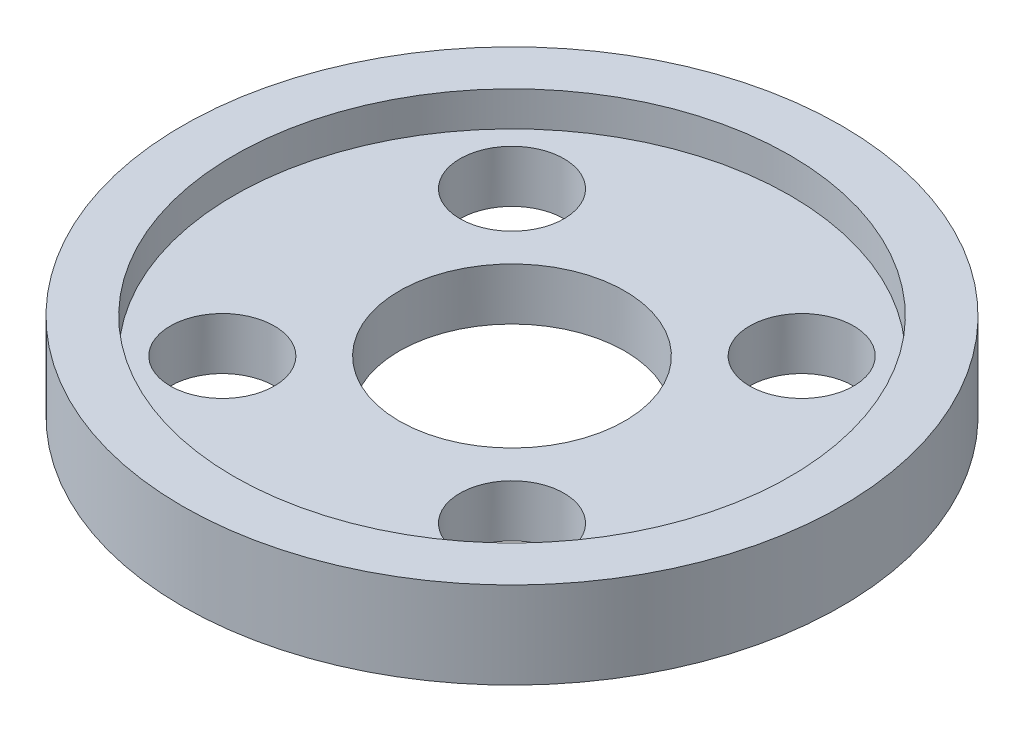
ISO-10303-21;
HEADER;
FILE_DESCRIPTION(('STEP AP214'),'2;1');
FILE_NAME('part.step','',(''),(''),'','','');
FILE_SCHEMA(('AUTOMOTIVE_DESIGN { 1 0 10303 214 1 1 1 1 }'));
ENDSEC;
DATA;
#1=APPLICATION_CONTEXT('core data for automotive mechanical design processes');
#2=APPLICATION_PROTOCOL_DEFINITION('international standard','automotive_design',2000,#1);
#3=PRODUCT_CONTEXT('',#1,'mechanical');
#4=PRODUCT('Part','Part','',(#3));
#5=PRODUCT_RELATED_PRODUCT_CATEGORY('part','',(#4));
#6=PRODUCT_DEFINITION_FORMATION('','',#4);
#7=PRODUCT_DEFINITION_CONTEXT('part definition',#1,'design');
#8=PRODUCT_DEFINITION('design','',#6,#7);
#9=PRODUCT_DEFINITION_SHAPE('','',#8);
#10=(LENGTH_UNIT() NAMED_UNIT(*) SI_UNIT(.MILLI.,.METRE.));
#11=(NAMED_UNIT(*) PLANE_ANGLE_UNIT() SI_UNIT($,.RADIAN.));
#12=(NAMED_UNIT(*) SI_UNIT($,.STERADIAN.) SOLID_ANGLE_UNIT());
#13=UNCERTAINTY_MEASURE_WITH_UNIT(LENGTH_MEASURE(1.E-05),#10,'distance_accuracy_value','');
#14=(GEOMETRIC_REPRESENTATION_CONTEXT(3) GLOBAL_UNCERTAINTY_ASSIGNED_CONTEXT((#13)) GLOBAL_UNIT_ASSIGNED_CONTEXT((#10,
#11,#12)) REPRESENTATION_CONTEXT('',''));
#15=CARTESIAN_POINT('',(0.,0.,0.));
#16=DIRECTION('',(0.,0.,1.));
#17=DIRECTION('',(1.,0.,0.));
#18=AXIS2_PLACEMENT_3D('',#15,#16,#17);
#19=CARTESIAN_POINT('',(0.,0.,0.));
#20=DIRECTION('',(0.,1.,0.));
#21=DIRECTION('',(0.,0.,1.));
#22=AXIS2_PLACEMENT_3D('',#19,#20,#21);
#23=CYLINDRICAL_SURFACE('',#22,19.);
#24=CARTESIAN_POINT('',(0.,32.,0.));
#25=DIRECTION('',(0.,-1.,0.));
#26=DIRECTION('',(0.,0.,-1.));
#27=AXIS2_PLACEMENT_3D('',#24,#25,#26);
#28=CIRCLE('',#27,19.);
#29=CARTESIAN_POINT('',(0.,32.,-19.));
#30=VERTEX_POINT('',#29);
#31=EDGE_CURVE('E61',#30,#30,#28,.F.);
#32=ORIENTED_EDGE('',*,*,#31,.T.);
#33=EDGE_LOOP('',(#32));
#34=FACE_BOUND('',#33,.T.);
#35=CARTESIAN_POINT('',(0.,37.,0.));
#36=DIRECTION('',(0.,1.,0.));
#37=DIRECTION('',(0.,0.,1.));
#38=AXIS2_PLACEMENT_3D('',#35,#36,#37);
#39=CIRCLE('',#38,19.);
#40=CARTESIAN_POINT('',(0.,37.,19.));
#41=VERTEX_POINT('',#40);
#42=EDGE_CURVE('E73',#41,#41,#39,.T.);
#43=ORIENTED_EDGE('',*,*,#42,.F.);
#44=EDGE_LOOP('',(#43));
#45=FACE_BOUND('',#44,.T.);
#46=ADVANCED_FACE('F43',(#34,#45),#23,.T.);
#47=CARTESIAN_POINT('',(0.,35.,0.));
#48=DIRECTION('',(0.,1.,0.));
#49=DIRECTION('',(0.,0.,1.));
#50=AXIS2_PLACEMENT_3D('',#47,#48,#49);
#51=CYLINDRICAL_SURFACE('',#50,16.035);
#52=CARTESIAN_POINT('',(0.,35.,0.));
#53=DIRECTION('',(0.,1.,0.));
#54=DIRECTION('',(0.,0.,1.));
#55=AXIS2_PLACEMENT_3D('',#52,#53,#54);
#56=CIRCLE('',#55,16.035);
#57=CARTESIAN_POINT('',(0.,35.,16.035));
#58=VERTEX_POINT('',#57);
#59=EDGE_CURVE('E52',#58,#58,#56,.T.);
#60=ORIENTED_EDGE('',*,*,#59,.F.);
#61=EDGE_LOOP('',(#60));
#62=FACE_BOUND('',#61,.T.);
#63=CARTESIAN_POINT('',(0.,37.,0.));
#64=DIRECTION('',(0.,1.,0.));
#65=DIRECTION('',(0.,0.,1.));
#66=AXIS2_PLACEMENT_3D('',#63,#64,#65);
#67=CIRCLE('',#66,16.035);
#68=CARTESIAN_POINT('',(0.,37.,16.035));
#69=VERTEX_POINT('',#68);
#70=EDGE_CURVE('E47',#69,#69,#67,.F.);
#71=ORIENTED_EDGE('',*,*,#70,.F.);
#72=EDGE_LOOP('',(#71));
#73=FACE_BOUND('',#72,.T.);
#74=ADVANCED_FACE('F124',(#62,#73),#51,.F.);
#75=CARTESIAN_POINT('',(0.,0.,0.));
#76=DIRECTION('',(0.,1.,0.));
#77=DIRECTION('',(0.,0.,1.));
#78=AXIS2_PLACEMENT_3D('',#75,#76,#77);
#79=CYLINDRICAL_SURFACE('',#78,6.5);
#80=CARTESIAN_POINT('',(0.,35.,0.));
#81=DIRECTION('',(0.,1.,0.));
#82=DIRECTION('',(0.,0.,1.));
#83=AXIS2_PLACEMENT_3D('',#80,#81,#82);
#84=CIRCLE('',#83,6.5);
#85=CARTESIAN_POINT('',(0.,35.,6.5));
#86=VERTEX_POINT('',#85);
#87=EDGE_CURVE('E10',#86,#86,#84,.F.);
#88=ORIENTED_EDGE('',*,*,#87,.F.);
#89=EDGE_LOOP('',(#88));
#90=FACE_BOUND('',#89,.T.);
#91=CARTESIAN_POINT('',(0.,32.,0.));
#92=DIRECTION('',(0.,-1.,0.));
#93=DIRECTION('',(0.,0.,-1.));
#94=AXIS2_PLACEMENT_3D('',#91,#92,#93);
#95=CIRCLE('',#94,6.5);
#96=CARTESIAN_POINT('',(0.,32.,-6.5));
#97=VERTEX_POINT('',#96);
#98=EDGE_CURVE('E93',#97,#97,#95,.F.);
#99=ORIENTED_EDGE('',*,*,#98,.F.);
#100=EDGE_LOOP('',(#99));
#101=FACE_BOUND('',#100,.T.);
#102=ADVANCED_FACE('F45',(#90,#101),#79,.F.);
#103=CARTESIAN_POINT('',(-8.35,-9.5,-8.35));
#104=DIRECTION('',(0.,1.,0.));
#105=DIRECTION('',(0.,0.,1.));
#106=AXIS2_PLACEMENT_3D('',#103,#104,#105);
#107=CYLINDRICAL_SURFACE('',#106,3.);
#108=CARTESIAN_POINT('',(-8.35,35.,-8.35));
#109=DIRECTION('',(0.,1.,0.));
#110=DIRECTION('',(0.,0.,1.));
#111=AXIS2_PLACEMENT_3D('',#108,#109,#110);
#112=CIRCLE('',#111,3.);
#113=CARTESIAN_POINT('',(-8.35,35.,-5.35));
#114=VERTEX_POINT('',#113);
#115=EDGE_CURVE('E58',#114,#114,#112,.T.);
#116=ORIENTED_EDGE('',*,*,#115,.T.);
#117=EDGE_LOOP('',(#116));
#118=FACE_BOUND('',#117,.T.);
#119=CARTESIAN_POINT('',(-8.35,32.,-8.35));
#120=DIRECTION('',(0.,-1.,0.));
#121=DIRECTION('',(0.,0.,-1.));
#122=AXIS2_PLACEMENT_3D('',#119,#120,#121);
#123=CIRCLE('',#122,3.);
#124=CARTESIAN_POINT('',(-8.35,32.,-11.35));
#125=VERTEX_POINT('',#124);
#126=EDGE_CURVE('E89',#125,#125,#123,.F.);
#127=ORIENTED_EDGE('',*,*,#126,.F.);
#128=EDGE_LOOP('',(#127));
#129=FACE_BOUND('',#128,.T.);
#130=ADVANCED_FACE('F112',(#118,#129),#107,.F.);
#131=CARTESIAN_POINT('',(8.35,-9.5,-8.35));
#132=DIRECTION('',(0.,1.,0.));
#133=DIRECTION('',(0.,0.,1.));
#134=AXIS2_PLACEMENT_3D('',#131,#132,#133);
#135=CYLINDRICAL_SURFACE('',#134,3.);
#136=CARTESIAN_POINT('',(8.35,35.,-8.35));
#137=DIRECTION('',(0.,1.,0.));
#138=DIRECTION('',(0.,0.,1.));
#139=AXIS2_PLACEMENT_3D('',#136,#137,#138);
#140=CIRCLE('',#139,3.);
#141=CARTESIAN_POINT('',(8.35,35.,-5.35));
#142=VERTEX_POINT('',#141);
#143=EDGE_CURVE('E98',#142,#142,#140,.T.);
#144=ORIENTED_EDGE('',*,*,#143,.T.);
#145=EDGE_LOOP('',(#144));
#146=FACE_BOUND('',#145,.T.);
#147=CARTESIAN_POINT('',(8.35,32.,-8.35));
#148=DIRECTION('',(0.,-1.,0.));
#149=DIRECTION('',(0.,0.,-1.));
#150=AXIS2_PLACEMENT_3D('',#147,#148,#149);
#151=CIRCLE('',#150,3.);
#152=CARTESIAN_POINT('',(8.35,32.,-11.35));
#153=VERTEX_POINT('',#152);
#154=EDGE_CURVE('E85',#153,#153,#151,.F.);
#155=ORIENTED_EDGE('',*,*,#154,.F.);
#156=EDGE_LOOP('',(#155));
#157=FACE_BOUND('',#156,.T.);
#158=ADVANCED_FACE('F137',(#146,#157),#135,.F.);
#159=CARTESIAN_POINT('',(8.35,-9.5,8.35));
#160=DIRECTION('',(0.,1.,0.));
#161=DIRECTION('',(0.,0.,1.));
#162=AXIS2_PLACEMENT_3D('',#159,#160,#161);
#163=CYLINDRICAL_SURFACE('',#162,3.);
#164=CARTESIAN_POINT('',(8.35,35.,8.35));
#165=DIRECTION('',(0.,1.,0.));
#166=DIRECTION('',(0.,0.,1.));
#167=AXIS2_PLACEMENT_3D('',#164,#165,#166);
#168=CIRCLE('',#167,3.);
#169=CARTESIAN_POINT('',(8.35,35.,11.35));
#170=VERTEX_POINT('',#169);
#171=EDGE_CURVE('E102',#170,#170,#168,.T.);
#172=ORIENTED_EDGE('',*,*,#171,.T.);
#173=EDGE_LOOP('',(#172));
#174=FACE_BOUND('',#173,.T.);
#175=CARTESIAN_POINT('',(8.35,32.,8.35));
#176=DIRECTION('',(0.,-1.,0.));
#177=DIRECTION('',(0.,0.,-1.));
#178=AXIS2_PLACEMENT_3D('',#175,#176,#177);
#179=CIRCLE('',#178,3.);
#180=CARTESIAN_POINT('',(8.35,32.,5.35));
#181=VERTEX_POINT('',#180);
#182=EDGE_CURVE('E70',#181,#181,#179,.F.);
#183=ORIENTED_EDGE('',*,*,#182,.F.);
#184=EDGE_LOOP('',(#183));
#185=FACE_BOUND('',#184,.T.);
#186=ADVANCED_FACE('F140',(#174,#185),#163,.F.);
#187=CARTESIAN_POINT('',(-8.35,-9.5,8.35));
#188=DIRECTION('',(0.,1.,0.));
#189=DIRECTION('',(0.,0.,1.));
#190=AXIS2_PLACEMENT_3D('',#187,#188,#189);
#191=CYLINDRICAL_SURFACE('',#190,3.);
#192=CARTESIAN_POINT('',(-8.35,35.,8.35));
#193=DIRECTION('',(0.,1.,0.));
#194=DIRECTION('',(0.,0.,1.));
#195=AXIS2_PLACEMENT_3D('',#192,#193,#194);
#196=CIRCLE('',#195,3.);
#197=CARTESIAN_POINT('',(-8.35,35.,11.35));
#198=VERTEX_POINT('',#197);
#199=EDGE_CURVE('E97',#198,#198,#196,.T.);
#200=ORIENTED_EDGE('',*,*,#199,.T.);
#201=EDGE_LOOP('',(#200));
#202=FACE_BOUND('',#201,.T.);
#203=CARTESIAN_POINT('',(-8.35,32.,8.35));
#204=DIRECTION('',(0.,-1.,0.));
#205=DIRECTION('',(0.,0.,-1.));
#206=AXIS2_PLACEMENT_3D('',#203,#204,#205);
#207=CIRCLE('',#206,3.);
#208=CARTESIAN_POINT('',(-8.35,32.,5.35));
#209=VERTEX_POINT('',#208);
#210=EDGE_CURVE('E64',#209,#209,#207,.F.);
#211=ORIENTED_EDGE('',*,*,#210,.F.);
#212=EDGE_LOOP('',(#211));
#213=FACE_BOUND('',#212,.T.);
#214=ADVANCED_FACE('F119',(#202,#213),#191,.F.);
#215=CARTESIAN_POINT('',(0.,35.,0.));
#216=DIRECTION('',(0.,1.,0.));
#217=DIRECTION('',(0.,0.,1.));
#218=AXIS2_PLACEMENT_3D('',#215,#216,#217);
#219=PLANE('',#218);
#220=ORIENTED_EDGE('',*,*,#199,.F.);
#221=EDGE_LOOP('',(#220));
#222=FACE_BOUND('',#221,.T.);
#223=ORIENTED_EDGE('',*,*,#171,.F.);
#224=EDGE_LOOP('',(#223));
#225=FACE_BOUND('',#224,.T.);
#226=ORIENTED_EDGE('',*,*,#143,.F.);
#227=EDGE_LOOP('',(#226));
#228=FACE_BOUND('',#227,.T.);
#229=ORIENTED_EDGE('',*,*,#115,.F.);
#230=EDGE_LOOP('',(#229));
#231=FACE_BOUND('',#230,.T.);
#232=ORIENTED_EDGE('',*,*,#59,.T.);
#233=EDGE_LOOP('',(#232));
#234=FACE_BOUND('',#233,.T.);
#235=ORIENTED_EDGE('',*,*,#87,.T.);
#236=EDGE_LOOP('',(#235));
#237=FACE_BOUND('',#236,.T.);
#238=ADVANCED_FACE('F115',(#222,#225,#228,#231,#234,#237),#219,.T.);
#239=CARTESIAN_POINT('',(0.,32.,0.));
#240=DIRECTION('',(0.,-1.,0.));
#241=DIRECTION('',(0.,0.,-1.));
#242=AXIS2_PLACEMENT_3D('',#239,#240,#241);
#243=PLANE('',#242);
#244=ORIENTED_EDGE('',*,*,#31,.F.);
#245=EDGE_LOOP('',(#244));
#246=FACE_BOUND('',#245,.T.);
#247=ORIENTED_EDGE('',*,*,#210,.T.);
#248=EDGE_LOOP('',(#247));
#249=FACE_BOUND('',#248,.T.);
#250=ORIENTED_EDGE('',*,*,#182,.T.);
#251=EDGE_LOOP('',(#250));
#252=FACE_BOUND('',#251,.T.);
#253=ORIENTED_EDGE('',*,*,#154,.T.);
#254=EDGE_LOOP('',(#253));
#255=FACE_BOUND('',#254,.T.);
#256=ORIENTED_EDGE('',*,*,#126,.T.);
#257=EDGE_LOOP('',(#256));
#258=FACE_BOUND('',#257,.T.);
#259=ORIENTED_EDGE('',*,*,#98,.T.);
#260=EDGE_LOOP('',(#259));
#261=FACE_BOUND('',#260,.T.);
#262=ADVANCED_FACE('F118',(#246,#249,#252,#255,#258,#261),#243,.T.);
#263=CARTESIAN_POINT('',(0.,37.,0.));
#264=DIRECTION('',(0.,1.,0.));
#265=DIRECTION('',(0.,0.,1.));
#266=AXIS2_PLACEMENT_3D('',#263,#264,#265);
#267=PLANE('',#266);
#268=ORIENTED_EDGE('',*,*,#42,.T.);
#269=EDGE_LOOP('',(#268));
#270=FACE_BOUND('',#269,.T.);
#271=ORIENTED_EDGE('',*,*,#70,.T.);
#272=EDGE_LOOP('',(#271));
#273=FACE_BOUND('',#272,.T.);
#274=ADVANCED_FACE('F150',(#270,#273),#267,.T.);
#275=CLOSED_SHELL('',(#46,#74,#102,#130,#158,#186,#214,#238,#262,#274));
#276=MANIFOLD_SOLID_BREP('B2',#275);
#277=ADVANCED_BREP_SHAPE_REPRESENTATION('',(#18,#276),#14);
#278=SHAPE_DEFINITION_REPRESENTATION(#9,#277);
ENDSEC;
END-ISO-10303-21;
